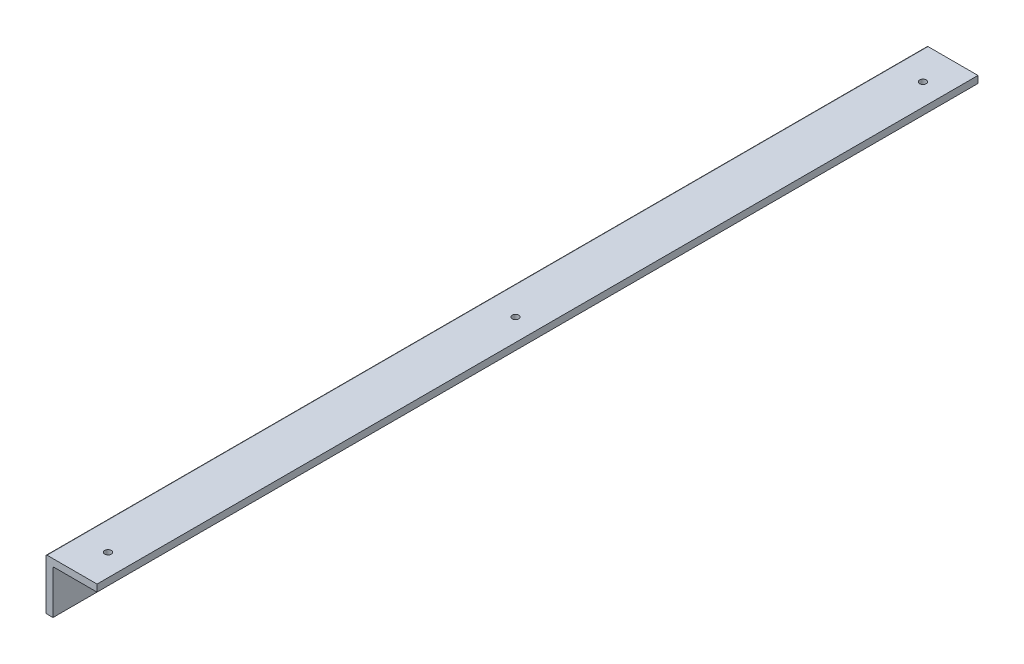
ISO-10303-21;
HEADER;
FILE_DESCRIPTION(('STEP AP214'),'2;1');
FILE_NAME('part.step','',(''),(''),'','','');
FILE_SCHEMA(('AUTOMOTIVE_DESIGN { 1 0 10303 214 1 1 1 1 }'));
ENDSEC;
DATA;
#1=APPLICATION_CONTEXT('core data for automotive mechanical design processes');
#2=APPLICATION_PROTOCOL_DEFINITION('international standard','automotive_design',2000,#1);
#3=PRODUCT_CONTEXT('',#1,'mechanical');
#4=PRODUCT('Part','Part','',(#3));
#5=PRODUCT_RELATED_PRODUCT_CATEGORY('part','',(#4));
#6=PRODUCT_DEFINITION_FORMATION('','',#4);
#7=PRODUCT_DEFINITION_CONTEXT('part definition',#1,'design');
#8=PRODUCT_DEFINITION('design','',#6,#7);
#9=PRODUCT_DEFINITION_SHAPE('','',#8);
#10=(LENGTH_UNIT() NAMED_UNIT(*) SI_UNIT(.MILLI.,.METRE.));
#11=(NAMED_UNIT(*) PLANE_ANGLE_UNIT() SI_UNIT($,.RADIAN.));
#12=(NAMED_UNIT(*) SI_UNIT($,.STERADIAN.) SOLID_ANGLE_UNIT());
#13=UNCERTAINTY_MEASURE_WITH_UNIT(LENGTH_MEASURE(1.E-05),#10,'distance_accuracy_value','');
#14=(GEOMETRIC_REPRESENTATION_CONTEXT(3) GLOBAL_UNCERTAINTY_ASSIGNED_CONTEXT((#13)) GLOBAL_UNIT_ASSIGNED_CONTEXT((#10,
#11,#12)) REPRESENTATION_CONTEXT('',''));
#15=CARTESIAN_POINT('',(0.,0.,0.));
#16=DIRECTION('',(0.,0.,1.));
#17=DIRECTION('',(1.,0.,0.));
#18=AXIS2_PLACEMENT_3D('',#15,#16,#17);
#19=CARTESIAN_POINT('',(0.,0.,400.));
#20=DIRECTION('',(0.,1.,0.));
#21=DIRECTION('',(0.,0.,1.));
#22=AXIS2_PLACEMENT_3D('',#19,#20,#21);
#23=PLANE('',#22);
#24=DIRECTION('',(1.,0.,0.));
#25=VECTOR('',#24,1.);
#26=CARTESIAN_POINT('',(0.,0.,0.));
#27=LINE('',#26,#25);
#28=CARTESIAN_POINT('',(0.,0.,0.));
#29=VERTEX_POINT('',#28);
#30=CARTESIAN_POINT('',(3.175,0.,0.));
#31=VERTEX_POINT('',#30);
#32=EDGE_CURVE('E131',#29,#31,#27,.T.);
#33=ORIENTED_EDGE('',*,*,#32,.T.);
#34=DIRECTION('',(0.,0.,-1.));
#35=VECTOR('',#34,1.);
#36=CARTESIAN_POINT('',(3.175,0.,400.));
#37=LINE('',#36,#35);
#38=CARTESIAN_POINT('',(3.175,0.,400.));
#39=VERTEX_POINT('',#38);
#40=EDGE_CURVE('E111',#39,#31,#37,.T.);
#41=ORIENTED_EDGE('',*,*,#40,.F.);
#42=DIRECTION('',(1.,0.,0.));
#43=VECTOR('',#42,1.);
#44=CARTESIAN_POINT('',(0.,0.,400.));
#45=LINE('',#44,#43);
#46=CARTESIAN_POINT('',(0.,0.,400.));
#47=VERTEX_POINT('',#46);
#48=EDGE_CURVE('E119',#47,#39,#45,.T.);
#49=ORIENTED_EDGE('',*,*,#48,.F.);
#50=DIRECTION('',(0.,0.,-1.));
#51=VECTOR('',#50,1.);
#52=CARTESIAN_POINT('',(0.,0.,400.));
#53=LINE('',#52,#51);
#54=EDGE_CURVE('E199',#47,#29,#53,.T.);
#55=ORIENTED_EDGE('',*,*,#54,.T.);
#56=EDGE_LOOP('',(#33,#41,#49,#55));
#57=FACE_BOUND('',#56,.T.);
#58=ADVANCED_FACE('F41',(#57),#23,.F.);
#59=CARTESIAN_POINT('',(3.175,0.,400.));
#60=DIRECTION('',(-1.,0.,0.));
#61=DIRECTION('',(0.,0.,1.));
#62=AXIS2_PLACEMENT_3D('',#59,#60,#61);
#63=PLANE('',#62);
#64=CARTESIAN_POINT('',(3.175,10.,385.));
#65=DIRECTION('',(1.,0.,0.));
#66=DIRECTION('',(0.,0.,-1.));
#67=AXIS2_PLACEMENT_3D('',#64,#65,#66);
#68=CIRCLE('',#67,1.49999999999997);
#69=CARTESIAN_POINT('',(3.175,10.,383.5));
#70=VERTEX_POINT('',#69);
#71=EDGE_CURVE('E408',#70,#70,#68,.T.);
#72=ORIENTED_EDGE('',*,*,#71,.F.);
#73=EDGE_LOOP('',(#72));
#74=FACE_BOUND('',#73,.T.);
#75=CARTESIAN_POINT('',(3.175,10.,15.));
#76=DIRECTION('',(1.,0.,0.));
#77=DIRECTION('',(0.,0.,-1.));
#78=AXIS2_PLACEMENT_3D('',#75,#76,#77);
#79=CIRCLE('',#78,1.5);
#80=CARTESIAN_POINT('',(3.175,10.,13.5));
#81=VERTEX_POINT('',#80);
#82=EDGE_CURVE('E407',#81,#81,#79,.T.);
#83=ORIENTED_EDGE('',*,*,#82,.F.);
#84=EDGE_LOOP('',(#83));
#85=FACE_BOUND('',#84,.T.);
#86=CARTESIAN_POINT('',(3.175,10.,200.));
#87=DIRECTION('',(1.,0.,0.));
#88=DIRECTION('',(0.,0.,-1.));
#89=AXIS2_PLACEMENT_3D('',#86,#87,#88);
#90=CIRCLE('',#89,1.5);
#91=CARTESIAN_POINT('',(3.175,10.,198.5));
#92=VERTEX_POINT('',#91);
#93=EDGE_CURVE('E150',#92,#92,#90,.T.);
#94=ORIENTED_EDGE('',*,*,#93,.F.);
#95=EDGE_LOOP('',(#94));
#96=FACE_BOUND('',#95,.T.);
#97=DIRECTION('',(0.,1.,0.));
#98=VECTOR('',#97,1.);
#99=CARTESIAN_POINT('',(3.175,0.,0.));
#100=LINE('',#99,#98);
#101=CARTESIAN_POINT('',(3.175,19.5,0.));
#102=VERTEX_POINT('',#101);
#103=EDGE_CURVE('E174',#31,#102,#100,.T.);
#104=ORIENTED_EDGE('',*,*,#103,.T.);
#105=DIRECTION('',(0.,0.,-1.));
#106=VECTOR('',#105,1.);
#107=CARTESIAN_POINT('',(3.175,19.5,400.));
#108=LINE('',#107,#106);
#109=CARTESIAN_POINT('',(3.175,19.5,400.));
#110=VERTEX_POINT('',#109);
#111=EDGE_CURVE('E114',#102,#110,#108,.F.);
#112=ORIENTED_EDGE('',*,*,#111,.T.);
#113=DIRECTION('',(0.,1.,0.));
#114=VECTOR('',#113,1.);
#115=CARTESIAN_POINT('',(3.175,0.,400.));
#116=LINE('',#115,#114);
#117=EDGE_CURVE('E106',#39,#110,#116,.T.);
#118=ORIENTED_EDGE('',*,*,#117,.F.);
#119=ORIENTED_EDGE('',*,*,#40,.T.);
#120=EDGE_LOOP('',(#104,#112,#118,#119));
#121=FACE_BOUND('',#120,.T.);
#122=ADVANCED_FACE('F109',(#74,#85,#96,#121),#63,.F.);
#123=CARTESIAN_POINT('',(0.,20.,400.));
#124=DIRECTION('',(0.,1.,0.));
#125=DIRECTION('',(0.,0.,1.));
#126=AXIS2_PLACEMENT_3D('',#123,#124,#125);
#127=PLANE('',#126);
#128=CARTESIAN_POINT('',(13.175,20.,15.));
#129=DIRECTION('',(0.,1.,0.));
#130=DIRECTION('',(0.,0.,1.));
#131=AXIS2_PLACEMENT_3D('',#128,#129,#130);
#132=CIRCLE('',#131,1.5);
#133=CARTESIAN_POINT('',(13.175,20.,16.5));
#134=VERTEX_POINT('',#133);
#135=EDGE_CURVE('E201',#134,#134,#132,.T.);
#136=ORIENTED_EDGE('',*,*,#135,.T.);
#137=EDGE_LOOP('',(#136));
#138=FACE_BOUND('',#137,.T.);
#139=CARTESIAN_POINT('',(13.175,20.,385.));
#140=DIRECTION('',(0.,1.,0.));
#141=DIRECTION('',(0.,0.,1.));
#142=AXIS2_PLACEMENT_3D('',#139,#140,#141);
#143=CIRCLE('',#142,1.49999999999999);
#144=CARTESIAN_POINT('',(13.175,20.,386.5));
#145=VERTEX_POINT('',#144);
#146=EDGE_CURVE('E381',#145,#145,#143,.T.);
#147=ORIENTED_EDGE('',*,*,#146,.T.);
#148=EDGE_LOOP('',(#147));
#149=FACE_BOUND('',#148,.T.);
#150=CARTESIAN_POINT('',(13.175,20.,200.));
#151=DIRECTION('',(0.,1.,0.));
#152=DIRECTION('',(0.,0.,1.));
#153=AXIS2_PLACEMENT_3D('',#150,#151,#152);
#154=CIRCLE('',#153,1.5);
#155=CARTESIAN_POINT('',(13.175,20.,201.5));
#156=VERTEX_POINT('',#155);
#157=EDGE_CURVE('E384',#156,#156,#154,.T.);
#158=ORIENTED_EDGE('',*,*,#157,.T.);
#159=EDGE_LOOP('',(#158));
#160=FACE_BOUND('',#159,.T.);
#161=DIRECTION('',(1.,0.,0.));
#162=VECTOR('',#161,1.);
#163=CARTESIAN_POINT('',(0.,20.,400.));
#164=LINE('',#163,#162);
#165=CARTESIAN_POINT('',(3.675,20.,400.));
#166=VERTEX_POINT('',#165);
#167=CARTESIAN_POINT('',(23.175,20.,400.));
#168=VERTEX_POINT('',#167);
#169=EDGE_CURVE('E118',#166,#168,#164,.T.);
#170=ORIENTED_EDGE('',*,*,#169,.F.);
#171=DIRECTION('',(0.,0.,-1.));
#172=VECTOR('',#171,1.);
#173=CARTESIAN_POINT('',(3.675,20.,0.));
#174=LINE('',#173,#172);
#175=CARTESIAN_POINT('',(3.675,20.,0.));
#176=VERTEX_POINT('',#175);
#177=EDGE_CURVE('E133',#166,#176,#174,.T.);
#178=ORIENTED_EDGE('',*,*,#177,.T.);
#179=DIRECTION('',(1.,0.,0.));
#180=VECTOR('',#179,1.);
#181=CARTESIAN_POINT('',(0.,20.,0.));
#182=LINE('',#181,#180);
#183=CARTESIAN_POINT('',(23.175,20.,0.));
#184=VERTEX_POINT('',#183);
#185=EDGE_CURVE('E176',#176,#184,#182,.T.);
#186=ORIENTED_EDGE('',*,*,#185,.T.);
#187=DIRECTION('',(0.,0.,-1.));
#188=VECTOR('',#187,1.);
#189=CARTESIAN_POINT('',(23.175,20.,400.));
#190=LINE('',#189,#188);
#191=EDGE_CURVE('E134',#168,#184,#190,.T.);
#192=ORIENTED_EDGE('',*,*,#191,.F.);
#193=EDGE_LOOP('',(#170,#178,#186,#192));
#194=FACE_BOUND('',#193,.T.);
#195=ADVANCED_FACE('F186',(#138,#149,#160,#194),#127,.F.);
#196=CARTESIAN_POINT('',(23.175,0.,400.));
#197=DIRECTION('',(-1.,0.,0.));
#198=DIRECTION('',(0.,0.,1.));
#199=AXIS2_PLACEMENT_3D('',#196,#197,#198);
#200=PLANE('',#199);
#201=DIRECTION('',(0.,1.,0.));
#202=VECTOR('',#201,1.);
#203=CARTESIAN_POINT('',(23.175,0.,0.));
#204=LINE('',#203,#202);
#205=CARTESIAN_POINT('',(23.175,23.175,0.));
#206=VERTEX_POINT('',#205);
#207=EDGE_CURVE('E205',#184,#206,#204,.T.);
#208=ORIENTED_EDGE('',*,*,#207,.T.);
#209=DIRECTION('',(0.,0.,-1.));
#210=VECTOR('',#209,1.);
#211=CARTESIAN_POINT('',(23.175,23.175,400.));
#212=LINE('',#211,#210);
#213=CARTESIAN_POINT('',(23.175,23.175,400.));
#214=VERTEX_POINT('',#213);
#215=EDGE_CURVE('E141',#214,#206,#212,.T.);
#216=ORIENTED_EDGE('',*,*,#215,.F.);
#217=DIRECTION('',(0.,1.,0.));
#218=VECTOR('',#217,1.);
#219=CARTESIAN_POINT('',(23.175,0.,400.));
#220=LINE('',#219,#218);
#221=EDGE_CURVE('E189',#168,#214,#220,.T.);
#222=ORIENTED_EDGE('',*,*,#221,.F.);
#223=ORIENTED_EDGE('',*,*,#191,.T.);
#224=EDGE_LOOP('',(#208,#216,#222,#223));
#225=FACE_BOUND('',#224,.T.);
#226=ADVANCED_FACE('F220',(#225),#200,.F.);
#227=CARTESIAN_POINT('',(0.,23.175,400.));
#228=DIRECTION('',(0.,1.,0.));
#229=DIRECTION('',(0.,0.,1.));
#230=AXIS2_PLACEMENT_3D('',#227,#228,#229);
#231=PLANE('',#230);
#232=CARTESIAN_POINT('',(13.175,23.175,15.));
#233=DIRECTION('',(0.,1.,0.));
#234=DIRECTION('',(0.,0.,1.));
#235=AXIS2_PLACEMENT_3D('',#232,#233,#234);
#236=CIRCLE('',#235,1.5);
#237=CARTESIAN_POINT('',(13.175,23.175,16.5));
#238=VERTEX_POINT('',#237);
#239=EDGE_CURVE('E157',#238,#238,#236,.T.);
#240=ORIENTED_EDGE('',*,*,#239,.F.);
#241=EDGE_LOOP('',(#240));
#242=FACE_BOUND('',#241,.T.);
#243=CARTESIAN_POINT('',(13.175,23.175,385.));
#244=DIRECTION('',(0.,1.,0.));
#245=DIRECTION('',(0.,0.,1.));
#246=AXIS2_PLACEMENT_3D('',#243,#244,#245);
#247=CIRCLE('',#246,1.49999999999999);
#248=CARTESIAN_POINT('',(13.175,23.175,386.5));
#249=VERTEX_POINT('',#248);
#250=EDGE_CURVE('E393',#249,#249,#247,.T.);
#251=ORIENTED_EDGE('',*,*,#250,.F.);
#252=EDGE_LOOP('',(#251));
#253=FACE_BOUND('',#252,.T.);
#254=CARTESIAN_POINT('',(13.175,23.175,200.));
#255=DIRECTION('',(0.,1.,0.));
#256=DIRECTION('',(0.,0.,1.));
#257=AXIS2_PLACEMENT_3D('',#254,#255,#256);
#258=CIRCLE('',#257,1.5);
#259=CARTESIAN_POINT('',(13.175,23.175,201.5));
#260=VERTEX_POINT('',#259);
#261=EDGE_CURVE('E387',#260,#260,#258,.T.);
#262=ORIENTED_EDGE('',*,*,#261,.F.);
#263=EDGE_LOOP('',(#262));
#264=FACE_BOUND('',#263,.T.);
#265=DIRECTION('',(1.,0.,0.));
#266=VECTOR('',#265,1.);
#267=CARTESIAN_POINT('',(0.,23.175,0.));
#268=LINE('',#267,#266);
#269=CARTESIAN_POINT('',(0.5,23.175,0.));
#270=VERTEX_POINT('',#269);
#271=EDGE_CURVE('E209',#270,#206,#268,.T.);
#272=ORIENTED_EDGE('',*,*,#271,.F.);
#273=DIRECTION('',(0.,0.,-1.));
#274=VECTOR('',#273,1.);
#275=CARTESIAN_POINT('',(0.5,23.175,400.));
#276=LINE('',#275,#274);
#277=CARTESIAN_POINT('',(0.5,23.175,400.));
#278=VERTEX_POINT('',#277);
#279=EDGE_CURVE('E57',#270,#278,#276,.F.);
#280=ORIENTED_EDGE('',*,*,#279,.T.);
#281=DIRECTION('',(1.,0.,0.));
#282=VECTOR('',#281,1.);
#283=CARTESIAN_POINT('',(0.,23.175,400.));
#284=LINE('',#283,#282);
#285=EDGE_CURVE('E192',#278,#214,#284,.T.);
#286=ORIENTED_EDGE('',*,*,#285,.T.);
#287=ORIENTED_EDGE('',*,*,#215,.T.);
#288=EDGE_LOOP('',(#272,#280,#286,#287));
#289=FACE_BOUND('',#288,.T.);
#290=ADVANCED_FACE('F218',(#242,#253,#264,#289),#231,.T.);
#291=CARTESIAN_POINT('',(0.,0.,400.));
#292=DIRECTION('',(-1.,0.,0.));
#293=DIRECTION('',(0.,0.,1.));
#294=AXIS2_PLACEMENT_3D('',#291,#292,#293);
#295=PLANE('',#294);
#296=CARTESIAN_POINT('',(0.,10.,385.));
#297=DIRECTION('',(-1.,0.,0.));
#298=DIRECTION('',(0.,0.,1.));
#299=AXIS2_PLACEMENT_3D('',#296,#297,#298);
#300=CIRCLE('',#299,1.49999999999997);
#301=CARTESIAN_POINT('',(0.,10.,386.5));
#302=VERTEX_POINT('',#301);
#303=EDGE_CURVE('E154',#302,#302,#300,.T.);
#304=ORIENTED_EDGE('',*,*,#303,.F.);
#305=EDGE_LOOP('',(#304));
#306=FACE_BOUND('',#305,.T.);
#307=CARTESIAN_POINT('',(0.,10.,15.));
#308=DIRECTION('',(-1.,0.,0.));
#309=DIRECTION('',(0.,0.,1.));
#310=AXIS2_PLACEMENT_3D('',#307,#308,#309);
#311=CIRCLE('',#310,1.5);
#312=CARTESIAN_POINT('',(0.,10.,16.5));
#313=VERTEX_POINT('',#312);
#314=EDGE_CURVE('E149',#313,#313,#311,.T.);
#315=ORIENTED_EDGE('',*,*,#314,.F.);
#316=EDGE_LOOP('',(#315));
#317=FACE_BOUND('',#316,.T.);
#318=CARTESIAN_POINT('',(0.,10.,200.));
#319=DIRECTION('',(-1.,0.,0.));
#320=DIRECTION('',(0.,0.,1.));
#321=AXIS2_PLACEMENT_3D('',#318,#319,#320);
#322=CIRCLE('',#321,1.5);
#323=CARTESIAN_POINT('',(0.,10.,201.5));
#324=VERTEX_POINT('',#323);
#325=EDGE_CURVE('E145',#324,#324,#322,.T.);
#326=ORIENTED_EDGE('',*,*,#325,.F.);
#327=EDGE_LOOP('',(#326));
#328=FACE_BOUND('',#327,.T.);
#329=DIRECTION('',(0.,1.,0.));
#330=VECTOR('',#329,1.);
#331=CARTESIAN_POINT('',(0.,0.,400.));
#332=LINE('',#331,#330);
#333=CARTESIAN_POINT('',(0.,22.675,400.));
#334=VERTEX_POINT('',#333);
#335=EDGE_CURVE('E125',#47,#334,#332,.T.);
#336=ORIENTED_EDGE('',*,*,#335,.T.);
#337=DIRECTION('',(0.,0.,-1.));
#338=VECTOR('',#337,1.);
#339=CARTESIAN_POINT('',(0.,22.675,400.));
#340=LINE('',#339,#338);
#341=CARTESIAN_POINT('',(0.,22.675,0.));
#342=VERTEX_POINT('',#341);
#343=EDGE_CURVE('E161',#334,#342,#340,.T.);
#344=ORIENTED_EDGE('',*,*,#343,.T.);
#345=DIRECTION('',(0.,1.,0.));
#346=VECTOR('',#345,1.);
#347=CARTESIAN_POINT('',(0.,0.,0.));
#348=LINE('',#347,#346);
#349=EDGE_CURVE('E128',#29,#342,#348,.T.);
#350=ORIENTED_EDGE('',*,*,#349,.F.);
#351=ORIENTED_EDGE('',*,*,#54,.F.);
#352=EDGE_LOOP('',(#336,#344,#350,#351));
#353=FACE_BOUND('',#352,.T.);
#354=ADVANCED_FACE('F226',(#306,#317,#328,#353),#295,.T.);
#355=CARTESIAN_POINT('',(0.,0.,400.));
#356=DIRECTION('',(0.,0.,1.));
#357=DIRECTION('',(1.,0.,0.));
#358=AXIS2_PLACEMENT_3D('',#355,#356,#357);
#359=PLANE('',#358);
#360=ORIENTED_EDGE('',*,*,#285,.F.);
#361=CARTESIAN_POINT('',(0.5,22.675,400.));
#362=DIRECTION('',(0.,0.,1.));
#363=DIRECTION('',(1.,0.,0.));
#364=AXIS2_PLACEMENT_3D('',#361,#362,#363);
#365=CIRCLE('',#364,0.5);
#366=EDGE_CURVE('E169',#278,#334,#365,.T.);
#367=ORIENTED_EDGE('',*,*,#366,.T.);
#368=ORIENTED_EDGE('',*,*,#335,.F.);
#369=ORIENTED_EDGE('',*,*,#48,.T.);
#370=ORIENTED_EDGE('',*,*,#117,.T.);
#371=CARTESIAN_POINT('',(3.675,19.5,400.));
#372=DIRECTION('',(0.,0.,1.));
#373=DIRECTION('',(1.,0.,0.));
#374=AXIS2_PLACEMENT_3D('',#371,#372,#373);
#375=CIRCLE('',#374,0.5);
#376=EDGE_CURVE('E11',#110,#166,#375,.F.);
#377=ORIENTED_EDGE('',*,*,#376,.T.);
#378=ORIENTED_EDGE('',*,*,#169,.T.);
#379=ORIENTED_EDGE('',*,*,#221,.T.);
#380=EDGE_LOOP('',(#360,#367,#368,#369,#370,#377,#378,#379));
#381=FACE_BOUND('',#380,.T.);
#382=ADVANCED_FACE('F123',(#381),#359,.T.);
#383=CARTESIAN_POINT('',(0.,0.,0.));
#384=DIRECTION('',(0.,0.,1.));
#385=DIRECTION('',(1.,0.,0.));
#386=AXIS2_PLACEMENT_3D('',#383,#384,#385);
#387=PLANE('',#386);
#388=ORIENTED_EDGE('',*,*,#349,.T.);
#389=CARTESIAN_POINT('',(0.5,22.675,0.));
#390=DIRECTION('',(0.,0.,1.));
#391=DIRECTION('',(1.,0.,0.));
#392=AXIS2_PLACEMENT_3D('',#389,#390,#391);
#393=CIRCLE('',#392,0.5);
#394=EDGE_CURVE('E65',#342,#270,#393,.F.);
#395=ORIENTED_EDGE('',*,*,#394,.T.);
#396=ORIENTED_EDGE('',*,*,#271,.T.);
#397=ORIENTED_EDGE('',*,*,#207,.F.);
#398=ORIENTED_EDGE('',*,*,#185,.F.);
#399=CARTESIAN_POINT('',(3.675,19.5,0.));
#400=DIRECTION('',(0.,0.,1.));
#401=DIRECTION('',(1.,0.,0.));
#402=AXIS2_PLACEMENT_3D('',#399,#400,#401);
#403=CIRCLE('',#402,0.5);
#404=EDGE_CURVE('E50',#176,#102,#403,.T.);
#405=ORIENTED_EDGE('',*,*,#404,.T.);
#406=ORIENTED_EDGE('',*,*,#103,.F.);
#407=ORIENTED_EDGE('',*,*,#32,.F.);
#408=EDGE_LOOP('',(#388,#395,#396,#397,#398,#405,#406,#407));
#409=FACE_BOUND('',#408,.T.);
#410=ADVANCED_FACE('F173',(#409),#387,.F.);
#411=CARTESIAN_POINT('',(13.175,-376.825,200.));
#412=DIRECTION('',(0.,1.,0.));
#413=DIRECTION('',(0.,0.,1.));
#414=AXIS2_PLACEMENT_3D('',#411,#412,#413);
#415=CYLINDRICAL_SURFACE('',#414,1.5);
#416=ORIENTED_EDGE('',*,*,#261,.T.);
#417=EDGE_LOOP('',(#416));
#418=FACE_BOUND('',#417,.T.);
#419=ORIENTED_EDGE('',*,*,#157,.F.);
#420=EDGE_LOOP('',(#419));
#421=FACE_BOUND('',#420,.T.);
#422=ADVANCED_FACE('F272',(#418,#421),#415,.F.);
#423=CARTESIAN_POINT('',(13.175,-376.825,385.));
#424=DIRECTION('',(0.,1.,0.));
#425=DIRECTION('',(0.,0.,1.));
#426=AXIS2_PLACEMENT_3D('',#423,#424,#425);
#427=CYLINDRICAL_SURFACE('',#426,1.49999999999999);
#428=ORIENTED_EDGE('',*,*,#250,.T.);
#429=EDGE_LOOP('',(#428));
#430=FACE_BOUND('',#429,.T.);
#431=ORIENTED_EDGE('',*,*,#146,.F.);
#432=EDGE_LOOP('',(#431));
#433=FACE_BOUND('',#432,.T.);
#434=ADVANCED_FACE('F269',(#430,#433),#427,.F.);
#435=CARTESIAN_POINT('',(13.175,-376.825,15.));
#436=DIRECTION('',(0.,1.,0.));
#437=DIRECTION('',(0.,0.,1.));
#438=AXIS2_PLACEMENT_3D('',#435,#436,#437);
#439=CYLINDRICAL_SURFACE('',#438,1.5);
#440=ORIENTED_EDGE('',*,*,#239,.T.);
#441=EDGE_LOOP('',(#440));
#442=FACE_BOUND('',#441,.T.);
#443=ORIENTED_EDGE('',*,*,#135,.F.);
#444=EDGE_LOOP('',(#443));
#445=FACE_BOUND('',#444,.T.);
#446=ADVANCED_FACE('F267',(#442,#445),#439,.F.);
#447=CARTESIAN_POINT('',(-396.825,10.,200.));
#448=DIRECTION('',(1.,0.,0.));
#449=DIRECTION('',(0.,0.,-1.));
#450=AXIS2_PLACEMENT_3D('',#447,#448,#449);
#451=CYLINDRICAL_SURFACE('',#450,1.5);
#452=ORIENTED_EDGE('',*,*,#325,.T.);
#453=EDGE_LOOP('',(#452));
#454=FACE_BOUND('',#453,.T.);
#455=ORIENTED_EDGE('',*,*,#93,.T.);
#456=EDGE_LOOP('',(#455));
#457=FACE_BOUND('',#456,.T.);
#458=ADVANCED_FACE('F260',(#454,#457),#451,.F.);
#459=CARTESIAN_POINT('',(-396.825,10.,15.));
#460=DIRECTION('',(1.,0.,0.));
#461=DIRECTION('',(0.,0.,-1.));
#462=AXIS2_PLACEMENT_3D('',#459,#460,#461);
#463=CYLINDRICAL_SURFACE('',#462,1.5);
#464=ORIENTED_EDGE('',*,*,#314,.T.);
#465=EDGE_LOOP('',(#464));
#466=FACE_BOUND('',#465,.T.);
#467=ORIENTED_EDGE('',*,*,#82,.T.);
#468=EDGE_LOOP('',(#467));
#469=FACE_BOUND('',#468,.T.);
#470=ADVANCED_FACE('F254',(#466,#469),#463,.F.);
#471=CARTESIAN_POINT('',(-396.825,10.,385.));
#472=DIRECTION('',(1.,0.,0.));
#473=DIRECTION('',(0.,0.,-1.));
#474=AXIS2_PLACEMENT_3D('',#471,#472,#473);
#475=CYLINDRICAL_SURFACE('',#474,1.49999999999997);
#476=ORIENTED_EDGE('',*,*,#303,.T.);
#477=EDGE_LOOP('',(#476));
#478=FACE_BOUND('',#477,.T.);
#479=ORIENTED_EDGE('',*,*,#71,.T.);
#480=EDGE_LOOP('',(#479));
#481=FACE_BOUND('',#480,.T.);
#482=ADVANCED_FACE('F249',(#478,#481),#475,.F.);
#483=CARTESIAN_POINT('',(3.675,19.5,400.));
#484=DIRECTION('',(0.,0.,1.));
#485=DIRECTION('',(1.,0.,0.));
#486=AXIS2_PLACEMENT_3D('',#483,#484,#485);
#487=CYLINDRICAL_SURFACE('',#486,0.5);
#488=ORIENTED_EDGE('',*,*,#376,.F.);
#489=ORIENTED_EDGE('',*,*,#111,.F.);
#490=ORIENTED_EDGE('',*,*,#404,.F.);
#491=ORIENTED_EDGE('',*,*,#177,.F.);
#492=EDGE_LOOP('',(#488,#489,#490,#491));
#493=FACE_BOUND('',#492,.T.);
#494=ADVANCED_FACE('F181',(#493),#487,.F.);
#495=CARTESIAN_POINT('',(0.5,22.675,400.));
#496=DIRECTION('',(0.,0.,-1.));
#497=DIRECTION('',(-1.,0.,0.));
#498=AXIS2_PLACEMENT_3D('',#495,#496,#497);
#499=CYLINDRICAL_SURFACE('',#498,0.5);
#500=ORIENTED_EDGE('',*,*,#366,.F.);
#501=ORIENTED_EDGE('',*,*,#279,.F.);
#502=ORIENTED_EDGE('',*,*,#394,.F.);
#503=ORIENTED_EDGE('',*,*,#343,.F.);
#504=EDGE_LOOP('',(#500,#501,#502,#503));
#505=FACE_BOUND('',#504,.T.);
#506=ADVANCED_FACE('F43',(#505),#499,.T.);
#507=CLOSED_SHELL('',(#58,#122,#195,#226,#290,#354,#382,#410,#422,#434,#446,#458,#470,#482,#494,#506));
#508=MANIFOLD_SOLID_BREP('B2',#507);
#509=ADVANCED_BREP_SHAPE_REPRESENTATION('',(#18,#508),#14);
#510=SHAPE_DEFINITION_REPRESENTATION(#9,#509);
ENDSEC;
END-ISO-10303-21;
